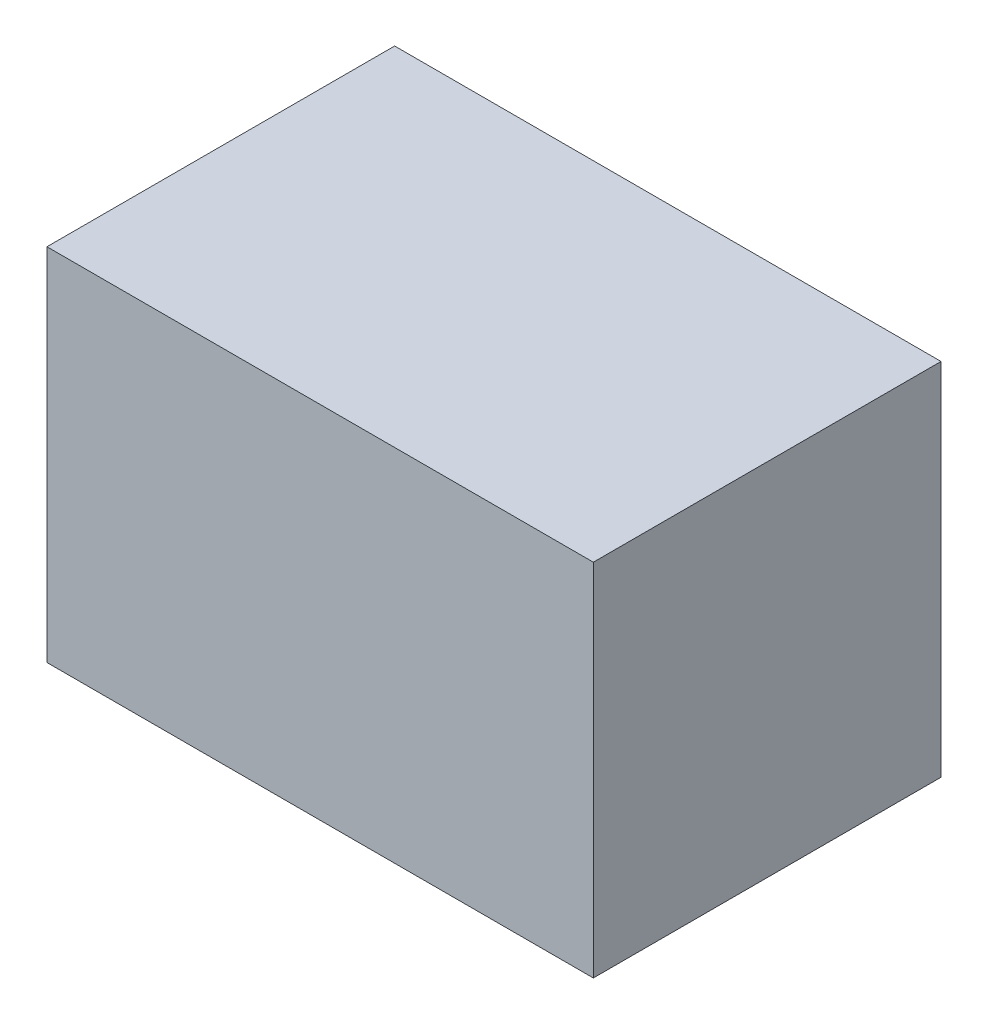
ISO-10303-21;
HEADER;
FILE_DESCRIPTION(('STEP AP214'),'2;1');
FILE_NAME('part.step','',(''),(''),'','','');
FILE_SCHEMA(('AUTOMOTIVE_DESIGN { 1 0 10303 214 1 1 1 1 }'));
ENDSEC;
DATA;
#1=APPLICATION_CONTEXT('core data for automotive mechanical design processes');
#2=APPLICATION_PROTOCOL_DEFINITION('international standard','automotive_design',2000,#1);
#3=PRODUCT_CONTEXT('',#1,'mechanical');
#4=PRODUCT('Part','Part','',(#3));
#5=PRODUCT_RELATED_PRODUCT_CATEGORY('part','',(#4));
#6=PRODUCT_DEFINITION_FORMATION('','',#4);
#7=PRODUCT_DEFINITION_CONTEXT('part definition',#1,'design');
#8=PRODUCT_DEFINITION('design','',#6,#7);
#9=PRODUCT_DEFINITION_SHAPE('','',#8);
#10=(LENGTH_UNIT() NAMED_UNIT(*) SI_UNIT(.MILLI.,.METRE.));
#11=(NAMED_UNIT(*) PLANE_ANGLE_UNIT() SI_UNIT($,.RADIAN.));
#12=(NAMED_UNIT(*) SI_UNIT($,.STERADIAN.) SOLID_ANGLE_UNIT());
#13=UNCERTAINTY_MEASURE_WITH_UNIT(LENGTH_MEASURE(1.E-05),#10,'distance_accuracy_value','');
#14=(GEOMETRIC_REPRESENTATION_CONTEXT(3) GLOBAL_UNCERTAINTY_ASSIGNED_CONTEXT((#13)) GLOBAL_UNIT_ASSIGNED_CONTEXT((#10,
#11,#12)) REPRESENTATION_CONTEXT('',''));
#15=CARTESIAN_POINT('',(0.,0.,0.));
#16=DIRECTION('',(0.,0.,1.));
#17=DIRECTION('',(1.,0.,0.));
#18=AXIS2_PLACEMENT_3D('',#15,#16,#17);
#19=CARTESIAN_POINT('',(-1.10000034,-0.72499982,0.));
#20=DIRECTION('',(0.,1.,0.));
#21=DIRECTION('',(1.,0.,0.));
#22=AXIS2_PLACEMENT_3D('',#19,#20,#21);
#23=PLANE('',#22);
#24=DIRECTION('',(1.,0.,0.));
#25=VECTOR('',#24,1.);
#26=CARTESIAN_POINT('',(-1.10000034,-0.72499982,0.));
#27=LINE('',#26,#25);
#28=CARTESIAN_POINT('',(-1.10000034,-0.72499982,0.));
#29=VERTEX_POINT('',#28);
#30=CARTESIAN_POINT('',(1.10000034,-0.72499982,0.));
#31=VERTEX_POINT('',#30);
#32=EDGE_CURVE('E11',#29,#31,#27,.T.);
#33=ORIENTED_EDGE('',*,*,#32,.T.);
#34=DIRECTION('',(0.,0.,1.));
#35=VECTOR('',#34,1.);
#36=CARTESIAN_POINT('',(1.10000034,-0.72499982,0.));
#37=LINE('',#36,#35);
#38=CARTESIAN_POINT('',(1.10000034,-0.72499982,1.39999974));
#39=VERTEX_POINT('',#38);
#40=EDGE_CURVE('E23',#31,#39,#37,.T.);
#41=ORIENTED_EDGE('',*,*,#40,.T.);
#42=DIRECTION('',(1.,0.,0.));
#43=VECTOR('',#42,1.);
#44=CARTESIAN_POINT('',(-1.10000034,-0.72499982,1.39999974));
#45=LINE('',#44,#43);
#46=CARTESIAN_POINT('',(-1.10000034,-0.72499982,1.39999974));
#47=VERTEX_POINT('',#46);
#48=EDGE_CURVE('E86',#47,#39,#45,.T.);
#49=ORIENTED_EDGE('',*,*,#48,.F.);
#50=DIRECTION('',(0.,0.,1.));
#51=VECTOR('',#50,1.);
#52=CARTESIAN_POINT('',(-1.10000034,-0.72499982,0.));
#53=LINE('',#52,#51);
#54=EDGE_CURVE('E35',#29,#47,#53,.T.);
#55=ORIENTED_EDGE('',*,*,#54,.F.);
#56=EDGE_LOOP('',(#33,#41,#49,#55));
#57=FACE_BOUND('',#56,.T.);
#58=ADVANCED_FACE('F16',(#57),#23,.F.);
#59=CARTESIAN_POINT('',(1.10000034,-0.72499982,0.));
#60=DIRECTION('',(-1.,0.,0.));
#61=DIRECTION('',(0.,1.,0.));
#62=AXIS2_PLACEMENT_3D('',#59,#60,#61);
#63=PLANE('',#62);
#64=DIRECTION('',(0.,1.,0.));
#65=VECTOR('',#64,1.);
#66=CARTESIAN_POINT('',(1.10000034,-0.72499982,0.));
#67=LINE('',#66,#65);
#68=CARTESIAN_POINT('',(1.10000034,0.72499982,0.));
#69=VERTEX_POINT('',#68);
#70=EDGE_CURVE('E83',#31,#69,#67,.T.);
#71=ORIENTED_EDGE('',*,*,#70,.T.);
#72=DIRECTION('',(0.,0.,1.));
#73=VECTOR('',#72,1.);
#74=CARTESIAN_POINT('',(1.10000034,0.72499982,0.));
#75=LINE('',#74,#73);
#76=CARTESIAN_POINT('',(1.10000034,0.72499982,1.39999974));
#77=VERTEX_POINT('',#76);
#78=EDGE_CURVE('E81',#69,#77,#75,.T.);
#79=ORIENTED_EDGE('',*,*,#78,.T.);
#80=DIRECTION('',(0.,1.,0.));
#81=VECTOR('',#80,1.);
#82=CARTESIAN_POINT('',(1.10000034,-0.72499982,1.39999974));
#83=LINE('',#82,#81);
#84=EDGE_CURVE('E61',#39,#77,#83,.T.);
#85=ORIENTED_EDGE('',*,*,#84,.F.);
#86=ORIENTED_EDGE('',*,*,#40,.F.);
#87=EDGE_LOOP('',(#71,#79,#85,#86));
#88=FACE_BOUND('',#87,.T.);
#89=ADVANCED_FACE('F88',(#88),#63,.F.);
#90=CARTESIAN_POINT('',(1.10000034,0.72499982,0.));
#91=DIRECTION('',(0.,-1.,0.));
#92=DIRECTION('',(-1.,0.,0.));
#93=AXIS2_PLACEMENT_3D('',#90,#91,#92);
#94=PLANE('',#93);
#95=DIRECTION('',(-1.,0.,0.));
#96=VECTOR('',#95,1.);
#97=CARTESIAN_POINT('',(1.10000034,0.72499982,0.));
#98=LINE('',#97,#96);
#99=CARTESIAN_POINT('',(-1.10000034,0.72499982,0.));
#100=VERTEX_POINT('',#99);
#101=EDGE_CURVE('E70',#69,#100,#98,.T.);
#102=ORIENTED_EDGE('',*,*,#101,.T.);
#103=DIRECTION('',(0.,0.,1.));
#104=VECTOR('',#103,1.);
#105=CARTESIAN_POINT('',(-1.10000034,0.72499982,0.));
#106=LINE('',#105,#104);
#107=CARTESIAN_POINT('',(-1.10000034,0.72499982,1.39999974));
#108=VERTEX_POINT('',#107);
#109=EDGE_CURVE('E64',#100,#108,#106,.T.);
#110=ORIENTED_EDGE('',*,*,#109,.T.);
#111=DIRECTION('',(-1.,0.,0.));
#112=VECTOR('',#111,1.);
#113=CARTESIAN_POINT('',(1.10000034,0.72499982,1.39999974));
#114=LINE('',#113,#112);
#115=EDGE_CURVE('E56',#77,#108,#114,.T.);
#116=ORIENTED_EDGE('',*,*,#115,.F.);
#117=ORIENTED_EDGE('',*,*,#78,.F.);
#118=EDGE_LOOP('',(#102,#110,#116,#117));
#119=FACE_BOUND('',#118,.T.);
#120=ADVANCED_FACE('F68',(#119),#94,.F.);
#121=CARTESIAN_POINT('',(-1.10000034,0.72499982,0.));
#122=DIRECTION('',(1.,0.,0.));
#123=DIRECTION('',(0.,-1.,0.));
#124=AXIS2_PLACEMENT_3D('',#121,#122,#123);
#125=PLANE('',#124);
#126=DIRECTION('',(0.,-1.,0.));
#127=VECTOR('',#126,1.);
#128=CARTESIAN_POINT('',(-1.10000034,0.72499982,0.));
#129=LINE('',#128,#127);
#130=EDGE_CURVE('E65',#100,#29,#129,.T.);
#131=ORIENTED_EDGE('',*,*,#130,.T.);
#132=ORIENTED_EDGE('',*,*,#54,.T.);
#133=DIRECTION('',(0.,-1.,0.));
#134=VECTOR('',#133,1.);
#135=CARTESIAN_POINT('',(-1.10000034,0.72499982,1.39999974));
#136=LINE('',#135,#134);
#137=EDGE_CURVE('E60',#108,#47,#136,.T.);
#138=ORIENTED_EDGE('',*,*,#137,.F.);
#139=ORIENTED_EDGE('',*,*,#109,.F.);
#140=EDGE_LOOP('',(#131,#132,#138,#139));
#141=FACE_BOUND('',#140,.T.);
#142=ADVANCED_FACE('F75',(#141),#125,.F.);
#143=CARTESIAN_POINT('',(-1.10000034,-0.72499982,0.));
#144=DIRECTION('',(0.,0.,-1.));
#145=DIRECTION('',(-1.,0.,0.));
#146=AXIS2_PLACEMENT_3D('',#143,#144,#145);
#147=PLANE('',#146);
#148=ORIENTED_EDGE('',*,*,#130,.F.);
#149=ORIENTED_EDGE('',*,*,#101,.F.);
#150=ORIENTED_EDGE('',*,*,#70,.F.);
#151=ORIENTED_EDGE('',*,*,#32,.F.);
#152=EDGE_LOOP('',(#148,#149,#150,#151));
#153=FACE_BOUND('',#152,.T.);
#154=ADVANCED_FACE('F90',(#153),#147,.T.);
#155=CARTESIAN_POINT('',(-1.10000034,-0.72499982,1.39999974));
#156=DIRECTION('',(0.,0.,-1.));
#157=DIRECTION('',(-1.,0.,0.));
#158=AXIS2_PLACEMENT_3D('',#155,#156,#157);
#159=PLANE('',#158);
#160=ORIENTED_EDGE('',*,*,#48,.T.);
#161=ORIENTED_EDGE('',*,*,#84,.T.);
#162=ORIENTED_EDGE('',*,*,#115,.T.);
#163=ORIENTED_EDGE('',*,*,#137,.T.);
#164=EDGE_LOOP('',(#160,#161,#162,#163));
#165=FACE_BOUND('',#164,.T.);
#166=ADVANCED_FACE('F58',(#165),#159,.F.);
#167=CLOSED_SHELL('',(#58,#89,#120,#142,#154,#166));
#168=MANIFOLD_SOLID_BREP('B1',#167);
#169=ADVANCED_BREP_SHAPE_REPRESENTATION('',(#18,#168),#14);
#170=SHAPE_DEFINITION_REPRESENTATION(#9,#169);
ENDSEC;
END-ISO-10303-21;
